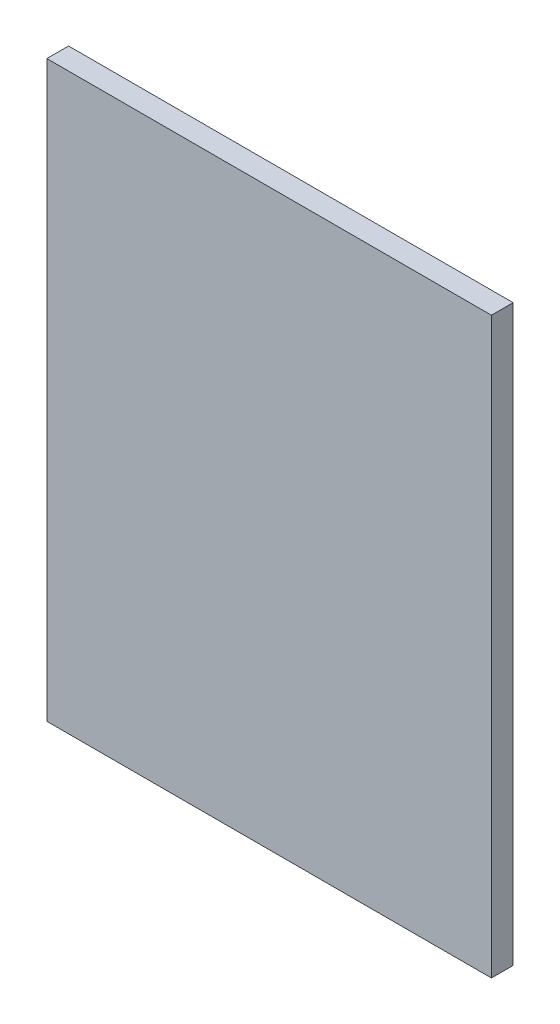
ISO-10303-21;
HEADER;
FILE_DESCRIPTION(('STEP AP214'),'2;1');
FILE_NAME('part.step','',(''),(''),'','','');
FILE_SCHEMA(('AUTOMOTIVE_DESIGN { 1 0 10303 214 1 1 1 1 }'));
ENDSEC;
DATA;
#1=APPLICATION_CONTEXT('core data for automotive mechanical design processes');
#2=APPLICATION_PROTOCOL_DEFINITION('international standard','automotive_design',2000,#1);
#3=PRODUCT_CONTEXT('',#1,'mechanical');
#4=PRODUCT('Part','Part','',(#3));
#5=PRODUCT_RELATED_PRODUCT_CATEGORY('part','',(#4));
#6=PRODUCT_DEFINITION_FORMATION('','',#4);
#7=PRODUCT_DEFINITION_CONTEXT('part definition',#1,'design');
#8=PRODUCT_DEFINITION('design','',#6,#7);
#9=PRODUCT_DEFINITION_SHAPE('','',#8);
#10=(LENGTH_UNIT() NAMED_UNIT(*) SI_UNIT(.MILLI.,.METRE.));
#11=(NAMED_UNIT(*) PLANE_ANGLE_UNIT() SI_UNIT($,.RADIAN.));
#12=(NAMED_UNIT(*) SI_UNIT($,.STERADIAN.) SOLID_ANGLE_UNIT());
#13=UNCERTAINTY_MEASURE_WITH_UNIT(LENGTH_MEASURE(1.E-05),#10,'distance_accuracy_value','');
#14=(GEOMETRIC_REPRESENTATION_CONTEXT(3) GLOBAL_UNCERTAINTY_ASSIGNED_CONTEXT((#13)) GLOBAL_UNIT_ASSIGNED_CONTEXT((#10,
#11,#12)) REPRESENTATION_CONTEXT('',''));
#15=CARTESIAN_POINT('',(0.,0.,0.));
#16=DIRECTION('',(0.,0.,1.));
#17=DIRECTION('',(1.,0.,0.));
#18=AXIS2_PLACEMENT_3D('',#15,#16,#17);
#19=CARTESIAN_POINT('',(0.,0.,2.794));
#20=DIRECTION('',(1.,0.,0.));
#21=DIRECTION('',(0.,1.,0.));
#22=AXIS2_PLACEMENT_3D('',#19,#20,#21);
#23=PLANE('',#22);
#24=DIRECTION('',(0.,-1.,0.));
#25=VECTOR('',#24,1.);
#26=CARTESIAN_POINT('',(0.,0.,0.));
#27=LINE('',#26,#25);
#28=CARTESIAN_POINT('',(0.,0.,0.));
#29=VERTEX_POINT('',#28);
#30=CARTESIAN_POINT('',(0.,-73.787,0.));
#31=VERTEX_POINT('',#30);
#32=EDGE_CURVE('E99',#29,#31,#27,.T.);
#33=ORIENTED_EDGE('',*,*,#32,.T.);
#34=DIRECTION('',(0.,0.,-1.));
#35=VECTOR('',#34,1.);
#36=CARTESIAN_POINT('',(0.,-73.787,2.794));
#37=LINE('',#36,#35);
#38=CARTESIAN_POINT('',(0.,-73.787,2.794));
#39=VERTEX_POINT('',#38);
#40=EDGE_CURVE('E11',#39,#31,#37,.T.);
#41=ORIENTED_EDGE('',*,*,#40,.F.);
#42=DIRECTION('',(0.,-1.,0.));
#43=VECTOR('',#42,1.);
#44=CARTESIAN_POINT('',(0.,0.,2.794));
#45=LINE('',#44,#43);
#46=CARTESIAN_POINT('',(0.,0.,2.794));
#47=VERTEX_POINT('',#46);
#48=EDGE_CURVE('E87',#47,#39,#45,.T.);
#49=ORIENTED_EDGE('',*,*,#48,.F.);
#50=DIRECTION('',(0.,0.,-1.));
#51=VECTOR('',#50,1.);
#52=CARTESIAN_POINT('',(0.,0.,2.794));
#53=LINE('',#52,#51);
#54=EDGE_CURVE('E95',#47,#29,#53,.T.);
#55=ORIENTED_EDGE('',*,*,#54,.T.);
#56=EDGE_LOOP('',(#33,#41,#49,#55));
#57=FACE_BOUND('',#56,.T.);
#58=ADVANCED_FACE('F36',(#57),#23,.F.);
#59=CARTESIAN_POINT('',(0.,-73.787,2.794));
#60=DIRECTION('',(0.,1.,0.));
#61=DIRECTION('',(0.,0.,1.));
#62=AXIS2_PLACEMENT_3D('',#59,#60,#61);
#63=PLANE('',#62);
#64=DIRECTION('',(1.,0.,0.));
#65=VECTOR('',#64,1.);
#66=CARTESIAN_POINT('',(0.,-73.787,0.));
#67=LINE('',#66,#65);
#68=CARTESIAN_POINT('',(57.15,-73.787,0.));
#69=VERTEX_POINT('',#68);
#70=EDGE_CURVE('E91',#31,#69,#67,.T.);
#71=ORIENTED_EDGE('',*,*,#70,.T.);
#72=DIRECTION('',(0.,0.,-1.));
#73=VECTOR('',#72,1.);
#74=CARTESIAN_POINT('',(57.15,-73.787,2.794));
#75=LINE('',#74,#73);
#76=CARTESIAN_POINT('',(57.15,-73.787,2.794));
#77=VERTEX_POINT('',#76);
#78=EDGE_CURVE('E44',#77,#69,#75,.T.);
#79=ORIENTED_EDGE('',*,*,#78,.F.);
#80=DIRECTION('',(1.,0.,0.));
#81=VECTOR('',#80,1.);
#82=CARTESIAN_POINT('',(0.,-73.787,2.794));
#83=LINE('',#82,#81);
#84=EDGE_CURVE('E82',#39,#77,#83,.T.);
#85=ORIENTED_EDGE('',*,*,#84,.F.);
#86=ORIENTED_EDGE('',*,*,#40,.T.);
#87=EDGE_LOOP('',(#71,#79,#85,#86));
#88=FACE_BOUND('',#87,.T.);
#89=ADVANCED_FACE('F90',(#88),#63,.F.);
#90=CARTESIAN_POINT('',(57.15,0.,2.794));
#91=DIRECTION('',(-1.,0.,0.));
#92=DIRECTION('',(0.,-1.,0.));
#93=AXIS2_PLACEMENT_3D('',#90,#91,#92);
#94=PLANE('',#93);
#95=DIRECTION('',(0.,1.,0.));
#96=VECTOR('',#95,1.);
#97=CARTESIAN_POINT('',(57.15,0.,0.));
#98=LINE('',#97,#96);
#99=CARTESIAN_POINT('',(57.15,0.,0.));
#100=VERTEX_POINT('',#99);
#101=EDGE_CURVE('E69',#69,#100,#98,.T.);
#102=ORIENTED_EDGE('',*,*,#101,.T.);
#103=DIRECTION('',(0.,0.,-1.));
#104=VECTOR('',#103,1.);
#105=CARTESIAN_POINT('',(57.15,0.,2.794));
#106=LINE('',#105,#104);
#107=CARTESIAN_POINT('',(57.15,0.,2.794));
#108=VERTEX_POINT('',#107);
#109=EDGE_CURVE('E92',#108,#100,#106,.T.);
#110=ORIENTED_EDGE('',*,*,#109,.F.);
#111=DIRECTION('',(0.,1.,0.));
#112=VECTOR('',#111,1.);
#113=CARTESIAN_POINT('',(57.15,0.,2.794));
#114=LINE('',#113,#112);
#115=EDGE_CURVE('E85',#77,#108,#114,.T.);
#116=ORIENTED_EDGE('',*,*,#115,.F.);
#117=ORIENTED_EDGE('',*,*,#78,.T.);
#118=EDGE_LOOP('',(#102,#110,#116,#117));
#119=FACE_BOUND('',#118,.T.);
#120=ADVANCED_FACE('F93',(#119),#94,.F.);
#121=CARTESIAN_POINT('',(0.,0.,2.794));
#122=DIRECTION('',(0.,-1.,0.));
#123=DIRECTION('',(0.,0.,-1.));
#124=AXIS2_PLACEMENT_3D('',#121,#122,#123);
#125=PLANE('',#124);
#126=DIRECTION('',(-1.,0.,0.));
#127=VECTOR('',#126,1.);
#128=CARTESIAN_POINT('',(0.,0.,0.));
#129=LINE('',#128,#127);
#130=EDGE_CURVE('E75',#100,#29,#129,.T.);
#131=ORIENTED_EDGE('',*,*,#130,.T.);
#132=ORIENTED_EDGE('',*,*,#54,.F.);
#133=DIRECTION('',(-1.,0.,0.));
#134=VECTOR('',#133,1.);
#135=CARTESIAN_POINT('',(0.,0.,2.794));
#136=LINE('',#135,#134);
#137=EDGE_CURVE('E52',#108,#47,#136,.T.);
#138=ORIENTED_EDGE('',*,*,#137,.F.);
#139=ORIENTED_EDGE('',*,*,#109,.T.);
#140=EDGE_LOOP('',(#131,#132,#138,#139));
#141=FACE_BOUND('',#140,.T.);
#142=ADVANCED_FACE('F106',(#141),#125,.F.);
#143=CARTESIAN_POINT('',(0.,0.,2.794));
#144=DIRECTION('',(0.,0.,1.));
#145=DIRECTION('',(1.,0.,0.));
#146=AXIS2_PLACEMENT_3D('',#143,#144,#145);
#147=PLANE('',#146);
#148=ORIENTED_EDGE('',*,*,#48,.T.);
#149=ORIENTED_EDGE('',*,*,#84,.T.);
#150=ORIENTED_EDGE('',*,*,#115,.T.);
#151=ORIENTED_EDGE('',*,*,#137,.T.);
#152=EDGE_LOOP('',(#148,#149,#150,#151));
#153=FACE_BOUND('',#152,.T.);
#154=ADVANCED_FACE('F83',(#153),#147,.T.);
#155=CARTESIAN_POINT('',(0.,0.,0.));
#156=DIRECTION('',(0.,0.,1.));
#157=DIRECTION('',(1.,0.,0.));
#158=AXIS2_PLACEMENT_3D('',#155,#156,#157);
#159=PLANE('',#158);
#160=ORIENTED_EDGE('',*,*,#32,.F.);
#161=ORIENTED_EDGE('',*,*,#130,.F.);
#162=ORIENTED_EDGE('',*,*,#101,.F.);
#163=ORIENTED_EDGE('',*,*,#70,.F.);
#164=EDGE_LOOP('',(#160,#161,#162,#163));
#165=FACE_BOUND('',#164,.T.);
#166=ADVANCED_FACE('F109',(#165),#159,.F.);
#167=CLOSED_SHELL('',(#58,#89,#120,#142,#154,#166));
#168=MANIFOLD_SOLID_BREP('B2',#167);
#169=ADVANCED_BREP_SHAPE_REPRESENTATION('',(#18,#168),#14);
#170=SHAPE_DEFINITION_REPRESENTATION(#9,#169);
ENDSEC;
END-ISO-10303-21;
